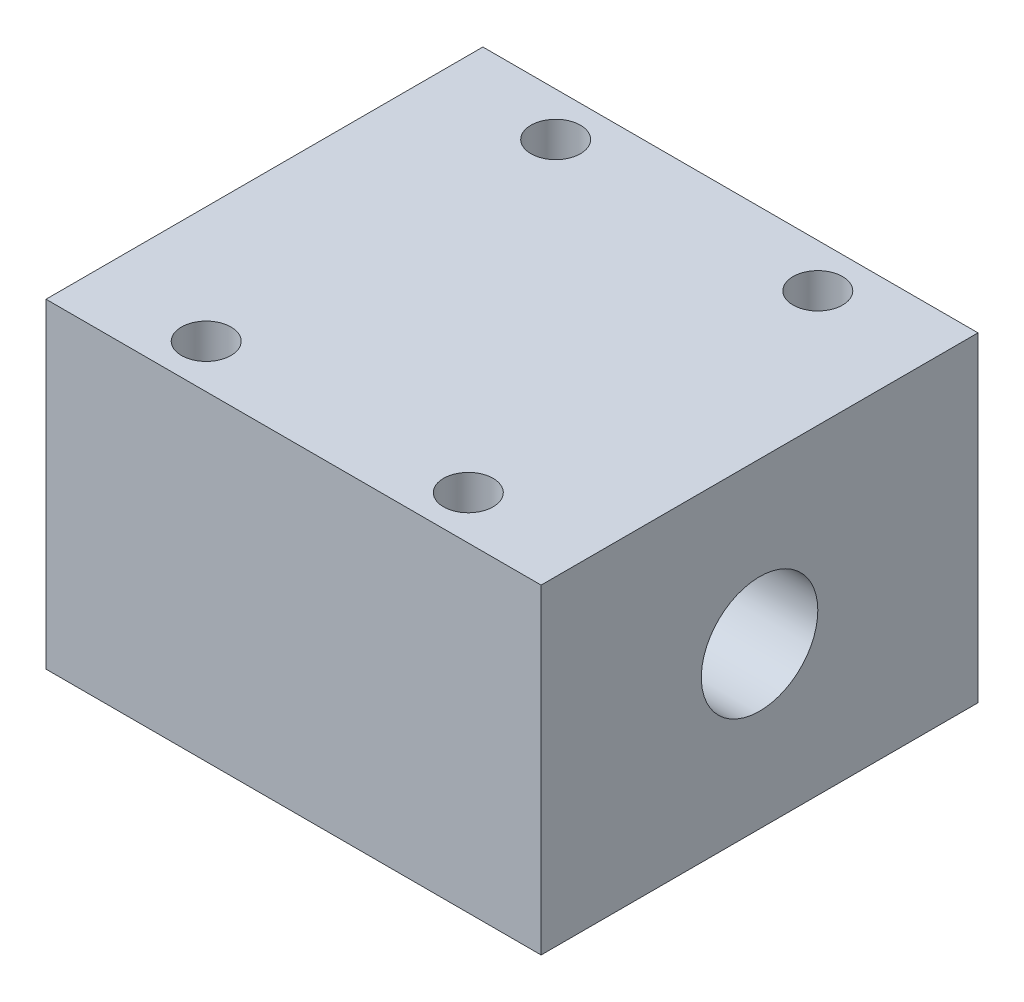
ISO-10303-21;
HEADER;
FILE_DESCRIPTION(('STEP AP214'),'2;1');
FILE_NAME('part.step','',(''),(''),'','','');
FILE_SCHEMA(('AUTOMOTIVE_DESIGN { 1 0 10303 214 1 1 1 1 }'));
ENDSEC;
DATA;
#1=APPLICATION_CONTEXT('core data for automotive mechanical design processes');
#2=APPLICATION_PROTOCOL_DEFINITION('international standard','automotive_design',2000,#1);
#3=PRODUCT_CONTEXT('',#1,'mechanical');
#4=PRODUCT('Part','Part','',(#3));
#5=PRODUCT_RELATED_PRODUCT_CATEGORY('part','',(#4));
#6=PRODUCT_DEFINITION_FORMATION('','',#4);
#7=PRODUCT_DEFINITION_CONTEXT('part definition',#1,'design');
#8=PRODUCT_DEFINITION('design','',#6,#7);
#9=PRODUCT_DEFINITION_SHAPE('','',#8);
#10=(LENGTH_UNIT() NAMED_UNIT(*) SI_UNIT(.MILLI.,.METRE.));
#11=(NAMED_UNIT(*) PLANE_ANGLE_UNIT() SI_UNIT($,.RADIAN.));
#12=(NAMED_UNIT(*) SI_UNIT($,.STERADIAN.) SOLID_ANGLE_UNIT());
#13=UNCERTAINTY_MEASURE_WITH_UNIT(LENGTH_MEASURE(1.E-05),#10,'distance_accuracy_value','');
#14=(GEOMETRIC_REPRESENTATION_CONTEXT(3) GLOBAL_UNCERTAINTY_ASSIGNED_CONTEXT((#13)) GLOBAL_UNIT_ASSIGNED_CONTEXT((#10,
#11,#12)) REPRESENTATION_CONTEXT('',''));
#15=CARTESIAN_POINT('',(0.,0.,0.));
#16=DIRECTION('',(0.,0.,1.));
#17=DIRECTION('',(1.,0.,0.));
#18=AXIS2_PLACEMENT_3D('',#15,#16,#17);
#19=CARTESIAN_POINT('',(0.,22.,0.));
#20=DIRECTION('',(0.,1.,0.));
#21=DIRECTION('',(0.,0.,1.));
#22=AXIS2_PLACEMENT_3D('',#19,#20,#21);
#23=PLANE('',#22);
#24=CARTESIAN_POINT('',(9.,22.,12.));
#25=DIRECTION('',(0.,1.,0.));
#26=DIRECTION('',(0.,0.,-1.));
#27=AXIS2_PLACEMENT_3D('',#24,#25,#26);
#28=CIRCLE('',#27,1.7);
#29=CARTESIAN_POINT('',(9.,22.,10.3));
#30=VERTEX_POINT('',#29);
#31=EDGE_CURVE('E122',#30,#30,#28,.T.);
#32=ORIENTED_EDGE('',*,*,#31,.F.);
#33=EDGE_LOOP('',(#32));
#34=FACE_BOUND('',#33,.T.);
#35=CARTESIAN_POINT('',(-9.,22.,-12.));
#36=DIRECTION('',(0.,1.,0.));
#37=DIRECTION('',(0.,0.,1.));
#38=AXIS2_PLACEMENT_3D('',#35,#36,#37);
#39=CIRCLE('',#38,1.7);
#40=CARTESIAN_POINT('',(-9.,22.,-10.3));
#41=VERTEX_POINT('',#40);
#42=EDGE_CURVE('E101',#41,#41,#39,.T.);
#43=ORIENTED_EDGE('',*,*,#42,.F.);
#44=EDGE_LOOP('',(#43));
#45=FACE_BOUND('',#44,.T.);
#46=DIRECTION('',(0.,0.,-1.));
#47=VECTOR('',#46,1.);
#48=CARTESIAN_POINT('',(17.,22.,-15.));
#49=LINE('',#48,#47);
#50=CARTESIAN_POINT('',(17.,22.,15.));
#51=VERTEX_POINT('',#50);
#52=CARTESIAN_POINT('',(17.,22.,-15.));
#53=VERTEX_POINT('',#52);
#54=EDGE_CURVE('E85',#51,#53,#49,.T.);
#55=ORIENTED_EDGE('',*,*,#54,.T.);
#56=DIRECTION('',(-1.,0.,0.));
#57=VECTOR('',#56,1.);
#58=CARTESIAN_POINT('',(-17.,22.,-15.));
#59=LINE('',#58,#57);
#60=CARTESIAN_POINT('',(-17.,22.,-15.));
#61=VERTEX_POINT('',#60);
#62=EDGE_CURVE('E80',#53,#61,#59,.T.);
#63=ORIENTED_EDGE('',*,*,#62,.T.);
#64=DIRECTION('',(0.,0.,1.));
#65=VECTOR('',#64,1.);
#66=CARTESIAN_POINT('',(-17.,22.,-15.));
#67=LINE('',#66,#65);
#68=CARTESIAN_POINT('',(-17.,22.,15.));
#69=VERTEX_POINT('',#68);
#70=EDGE_CURVE('E83',#61,#69,#67,.T.);
#71=ORIENTED_EDGE('',*,*,#70,.T.);
#72=DIRECTION('',(1.,0.,0.));
#73=VECTOR('',#72,1.);
#74=CARTESIAN_POINT('',(-17.,22.,15.));
#75=LINE('',#74,#73);
#76=EDGE_CURVE('E50',#69,#51,#75,.T.);
#77=ORIENTED_EDGE('',*,*,#76,.T.);
#78=EDGE_LOOP('',(#55,#63,#71,#77));
#79=FACE_BOUND('',#78,.T.);
#80=CARTESIAN_POINT('',(9.,22.,-12.));
#81=DIRECTION('',(0.,1.,0.));
#82=DIRECTION('',(0.,0.,1.));
#83=AXIS2_PLACEMENT_3D('',#80,#81,#82);
#84=CIRCLE('',#83,1.7);
#85=CARTESIAN_POINT('',(9.,22.,-10.3));
#86=VERTEX_POINT('',#85);
#87=EDGE_CURVE('E116',#86,#86,#84,.T.);
#88=ORIENTED_EDGE('',*,*,#87,.F.);
#89=EDGE_LOOP('',(#88));
#90=FACE_BOUND('',#89,.T.);
#91=CARTESIAN_POINT('',(-8.99999999999999,22.,12.));
#92=DIRECTION('',(0.,1.,0.));
#93=DIRECTION('',(0.,0.,-1.));
#94=AXIS2_PLACEMENT_3D('',#91,#92,#93);
#95=CIRCLE('',#94,1.7);
#96=CARTESIAN_POINT('',(-8.99999999999999,22.,10.3));
#97=VERTEX_POINT('',#96);
#98=EDGE_CURVE('E128',#97,#97,#95,.T.);
#99=ORIENTED_EDGE('',*,*,#98,.F.);
#100=EDGE_LOOP('',(#99));
#101=FACE_BOUND('',#100,.T.);
#102=ADVANCED_FACE('F32',(#34,#45,#79,#90,#101),#23,.T.);
#103=CARTESIAN_POINT('',(0.,0.,0.));
#104=DIRECTION('',(0.,1.,0.));
#105=DIRECTION('',(0.,0.,1.));
#106=AXIS2_PLACEMENT_3D('',#103,#104,#105);
#107=PLANE('',#106);
#108=DIRECTION('',(0.,0.,-1.));
#109=VECTOR('',#108,1.);
#110=CARTESIAN_POINT('',(17.,0.,-15.));
#111=LINE('',#110,#109);
#112=CARTESIAN_POINT('',(17.,0.,15.));
#113=VERTEX_POINT('',#112);
#114=CARTESIAN_POINT('',(17.,0.,-15.));
#115=VERTEX_POINT('',#114);
#116=EDGE_CURVE('E98',#113,#115,#111,.T.);
#117=ORIENTED_EDGE('',*,*,#116,.F.);
#118=DIRECTION('',(1.,0.,0.));
#119=VECTOR('',#118,1.);
#120=CARTESIAN_POINT('',(-17.,0.,15.));
#121=LINE('',#120,#119);
#122=CARTESIAN_POINT('',(-17.,0.,15.));
#123=VERTEX_POINT('',#122);
#124=EDGE_CURVE('E73',#123,#113,#121,.T.);
#125=ORIENTED_EDGE('',*,*,#124,.F.);
#126=DIRECTION('',(0.,0.,1.));
#127=VECTOR('',#126,1.);
#128=CARTESIAN_POINT('',(-17.,0.,-15.));
#129=LINE('',#128,#127);
#130=CARTESIAN_POINT('',(-17.,0.,-15.));
#131=VERTEX_POINT('',#130);
#132=EDGE_CURVE('E67',#131,#123,#129,.T.);
#133=ORIENTED_EDGE('',*,*,#132,.F.);
#134=DIRECTION('',(-1.,0.,0.));
#135=VECTOR('',#134,1.);
#136=CARTESIAN_POINT('',(-17.,0.,-15.));
#137=LINE('',#136,#135);
#138=EDGE_CURVE('E89',#115,#131,#137,.T.);
#139=ORIENTED_EDGE('',*,*,#138,.F.);
#140=EDGE_LOOP('',(#117,#125,#133,#139));
#141=FACE_BOUND('',#140,.T.);
#142=CARTESIAN_POINT('',(-9.,0.,-12.));
#143=DIRECTION('',(0.,1.,0.));
#144=DIRECTION('',(0.,0.,1.));
#145=AXIS2_PLACEMENT_3D('',#142,#143,#144);
#146=CIRCLE('',#145,1.7);
#147=CARTESIAN_POINT('',(-9.,0.,-10.3));
#148=VERTEX_POINT('',#147);
#149=EDGE_CURVE('E113',#148,#148,#146,.T.);
#150=ORIENTED_EDGE('',*,*,#149,.T.);
#151=EDGE_LOOP('',(#150));
#152=FACE_BOUND('',#151,.T.);
#153=CARTESIAN_POINT('',(9.,0.,-12.));
#154=DIRECTION('',(0.,1.,0.));
#155=DIRECTION('',(0.,0.,1.));
#156=AXIS2_PLACEMENT_3D('',#153,#154,#155);
#157=CIRCLE('',#156,1.7);
#158=CARTESIAN_POINT('',(9.,0.,-10.3));
#159=VERTEX_POINT('',#158);
#160=EDGE_CURVE('E119',#159,#159,#157,.T.);
#161=ORIENTED_EDGE('',*,*,#160,.T.);
#162=EDGE_LOOP('',(#161));
#163=FACE_BOUND('',#162,.T.);
#164=CARTESIAN_POINT('',(9.,0.,12.));
#165=DIRECTION('',(0.,1.,0.));
#166=DIRECTION('',(0.,0.,-1.));
#167=AXIS2_PLACEMENT_3D('',#164,#165,#166);
#168=CIRCLE('',#167,1.7);
#169=CARTESIAN_POINT('',(9.,0.,10.3));
#170=VERTEX_POINT('',#169);
#171=EDGE_CURVE('E125',#170,#170,#168,.T.);
#172=ORIENTED_EDGE('',*,*,#171,.T.);
#173=EDGE_LOOP('',(#172));
#174=FACE_BOUND('',#173,.T.);
#175=CARTESIAN_POINT('',(-8.99999999999999,0.,12.));
#176=DIRECTION('',(0.,1.,0.));
#177=DIRECTION('',(0.,0.,-1.));
#178=AXIS2_PLACEMENT_3D('',#175,#176,#177);
#179=CIRCLE('',#178,1.7);
#180=CARTESIAN_POINT('',(-8.99999999999999,0.,10.3));
#181=VERTEX_POINT('',#180);
#182=EDGE_CURVE('E131',#181,#181,#179,.T.);
#183=ORIENTED_EDGE('',*,*,#182,.T.);
#184=EDGE_LOOP('',(#183));
#185=FACE_BOUND('',#184,.T.);
#186=ADVANCED_FACE('F109',(#141,#152,#163,#174,#185),#107,.F.);
#187=CARTESIAN_POINT('',(17.,22.,-15.));
#188=DIRECTION('',(-1.,0.,0.));
#189=DIRECTION('',(0.,0.,1.));
#190=AXIS2_PLACEMENT_3D('',#187,#188,#189);
#191=PLANE('',#190);
#192=CARTESIAN_POINT('',(17.,11.,0.));
#193=DIRECTION('',(1.,0.,0.));
#194=DIRECTION('',(0.,0.,-1.));
#195=AXIS2_PLACEMENT_3D('',#192,#193,#194);
#196=CIRCLE('',#195,4.);
#197=CARTESIAN_POINT('',(17.,11.,-4.));
#198=VERTEX_POINT('',#197);
#199=EDGE_CURVE('E136',#198,#198,#196,.T.);
#200=ORIENTED_EDGE('',*,*,#199,.F.);
#201=EDGE_LOOP('',(#200));
#202=FACE_BOUND('',#201,.T.);
#203=ORIENTED_EDGE('',*,*,#116,.T.);
#204=DIRECTION('',(0.,-1.,0.));
#205=VECTOR('',#204,1.);
#206=CARTESIAN_POINT('',(17.,22.,-15.));
#207=LINE('',#206,#205);
#208=EDGE_CURVE('E11',#53,#115,#207,.T.);
#209=ORIENTED_EDGE('',*,*,#208,.F.);
#210=ORIENTED_EDGE('',*,*,#54,.F.);
#211=DIRECTION('',(0.,-1.,0.));
#212=VECTOR('',#211,1.);
#213=CARTESIAN_POINT('',(17.,22.,15.));
#214=LINE('',#213,#212);
#215=EDGE_CURVE('E94',#51,#113,#214,.T.);
#216=ORIENTED_EDGE('',*,*,#215,.T.);
#217=EDGE_LOOP('',(#203,#209,#210,#216));
#218=FACE_BOUND('',#217,.T.);
#219=ADVANCED_FACE('F34',(#202,#218),#191,.F.);
#220=CARTESIAN_POINT('',(-17.,22.,-15.));
#221=DIRECTION('',(0.,0.,1.));
#222=DIRECTION('',(1.,0.,0.));
#223=AXIS2_PLACEMENT_3D('',#220,#221,#222);
#224=PLANE('',#223);
#225=ORIENTED_EDGE('',*,*,#138,.T.);
#226=DIRECTION('',(0.,-1.,0.));
#227=VECTOR('',#226,1.);
#228=CARTESIAN_POINT('',(-17.,22.,-15.));
#229=LINE('',#228,#227);
#230=EDGE_CURVE('E42',#61,#131,#229,.T.);
#231=ORIENTED_EDGE('',*,*,#230,.F.);
#232=ORIENTED_EDGE('',*,*,#62,.F.);
#233=ORIENTED_EDGE('',*,*,#208,.T.);
#234=EDGE_LOOP('',(#225,#231,#232,#233));
#235=FACE_BOUND('',#234,.T.);
#236=ADVANCED_FACE('F88',(#235),#224,.F.);
#237=CARTESIAN_POINT('',(-17.,22.,-15.));
#238=DIRECTION('',(1.,0.,0.));
#239=DIRECTION('',(0.,0.,-1.));
#240=AXIS2_PLACEMENT_3D('',#237,#238,#239);
#241=PLANE('',#240);
#242=CARTESIAN_POINT('',(-17.,11.,0.));
#243=DIRECTION('',(1.,0.,0.));
#244=DIRECTION('',(0.,0.,-1.));
#245=AXIS2_PLACEMENT_3D('',#242,#243,#244);
#246=CIRCLE('',#245,4.);
#247=CARTESIAN_POINT('',(-17.,11.,-4.));
#248=VERTEX_POINT('',#247);
#249=EDGE_CURVE('E36',#248,#248,#246,.T.);
#250=ORIENTED_EDGE('',*,*,#249,.T.);
#251=EDGE_LOOP('',(#250));
#252=FACE_BOUND('',#251,.T.);
#253=ORIENTED_EDGE('',*,*,#132,.T.);
#254=DIRECTION('',(0.,-1.,0.));
#255=VECTOR('',#254,1.);
#256=CARTESIAN_POINT('',(-17.,22.,15.));
#257=LINE('',#256,#255);
#258=EDGE_CURVE('E90',#69,#123,#257,.T.);
#259=ORIENTED_EDGE('',*,*,#258,.F.);
#260=ORIENTED_EDGE('',*,*,#70,.F.);
#261=ORIENTED_EDGE('',*,*,#230,.T.);
#262=EDGE_LOOP('',(#253,#259,#260,#261));
#263=FACE_BOUND('',#262,.T.);
#264=ADVANCED_FACE('F92',(#252,#263),#241,.F.);
#265=CARTESIAN_POINT('',(-17.,22.,15.));
#266=DIRECTION('',(0.,0.,-1.));
#267=DIRECTION('',(-1.,0.,0.));
#268=AXIS2_PLACEMENT_3D('',#265,#266,#267);
#269=PLANE('',#268);
#270=ORIENTED_EDGE('',*,*,#124,.T.);
#271=ORIENTED_EDGE('',*,*,#215,.F.);
#272=ORIENTED_EDGE('',*,*,#76,.F.);
#273=ORIENTED_EDGE('',*,*,#258,.T.);
#274=EDGE_LOOP('',(#270,#271,#272,#273));
#275=FACE_BOUND('',#274,.T.);
#276=ADVANCED_FACE('F106',(#275),#269,.F.);
#277=CARTESIAN_POINT('',(-9.,22.,-12.));
#278=DIRECTION('',(0.,-1.,0.));
#279=DIRECTION('',(0.,0.,-1.));
#280=AXIS2_PLACEMENT_3D('',#277,#278,#279);
#281=CYLINDRICAL_SURFACE('',#280,1.7);
#282=ORIENTED_EDGE('',*,*,#42,.T.);
#283=EDGE_LOOP('',(#282));
#284=FACE_BOUND('',#283,.T.);
#285=ORIENTED_EDGE('',*,*,#149,.F.);
#286=EDGE_LOOP('',(#285));
#287=FACE_BOUND('',#286,.T.);
#288=ADVANCED_FACE('F164',(#284,#287),#281,.F.);
#289=CARTESIAN_POINT('',(9.,22.,-12.));
#290=DIRECTION('',(0.,-1.,0.));
#291=DIRECTION('',(0.,0.,-1.));
#292=AXIS2_PLACEMENT_3D('',#289,#290,#291);
#293=CYLINDRICAL_SURFACE('',#292,1.7);
#294=ORIENTED_EDGE('',*,*,#87,.T.);
#295=EDGE_LOOP('',(#294));
#296=FACE_BOUND('',#295,.T.);
#297=ORIENTED_EDGE('',*,*,#160,.F.);
#298=EDGE_LOOP('',(#297));
#299=FACE_BOUND('',#298,.T.);
#300=ADVANCED_FACE('F205',(#296,#299),#293,.F.);
#301=CARTESIAN_POINT('',(9.,22.,12.));
#302=DIRECTION('',(0.,-1.,0.));
#303=DIRECTION('',(0.,0.,-1.));
#304=AXIS2_PLACEMENT_3D('',#301,#302,#303);
#305=CYLINDRICAL_SURFACE('',#304,1.7);
#306=ORIENTED_EDGE('',*,*,#31,.T.);
#307=EDGE_LOOP('',(#306));
#308=FACE_BOUND('',#307,.T.);
#309=ORIENTED_EDGE('',*,*,#171,.F.);
#310=EDGE_LOOP('',(#309));
#311=FACE_BOUND('',#310,.T.);
#312=ADVANCED_FACE('F151',(#308,#311),#305,.F.);
#313=CARTESIAN_POINT('',(-8.99999999999999,22.,12.));
#314=DIRECTION('',(0.,-1.,0.));
#315=DIRECTION('',(0.,0.,-1.));
#316=AXIS2_PLACEMENT_3D('',#313,#314,#315);
#317=CYLINDRICAL_SURFACE('',#316,1.7);
#318=ORIENTED_EDGE('',*,*,#98,.T.);
#319=EDGE_LOOP('',(#318));
#320=FACE_BOUND('',#319,.T.);
#321=ORIENTED_EDGE('',*,*,#182,.F.);
#322=EDGE_LOOP('',(#321));
#323=FACE_BOUND('',#322,.T.);
#324=ADVANCED_FACE('F146',(#320,#323),#317,.F.);
#325=CARTESIAN_POINT('',(-25.,11.,0.));
#326=DIRECTION('',(1.,0.,0.));
#327=DIRECTION('',(0.,0.,-1.));
#328=AXIS2_PLACEMENT_3D('',#325,#326,#327);
#329=CYLINDRICAL_SURFACE('',#328,4.);
#330=ORIENTED_EDGE('',*,*,#199,.T.);
#331=EDGE_LOOP('',(#330));
#332=FACE_BOUND('',#331,.T.);
#333=ORIENTED_EDGE('',*,*,#249,.F.);
#334=EDGE_LOOP('',(#333));
#335=FACE_BOUND('',#334,.T.);
#336=ADVANCED_FACE('F144',(#332,#335),#329,.F.);
#337=CLOSED_SHELL('',(#102,#186,#219,#236,#264,#276,#288,#300,#312,#324,#336));
#338=MANIFOLD_SOLID_BREP('B2',#337);
#339=ADVANCED_BREP_SHAPE_REPRESENTATION('',(#18,#338),#14);
#340=SHAPE_DEFINITION_REPRESENTATION(#9,#339);
ENDSEC;
END-ISO-10303-21;
